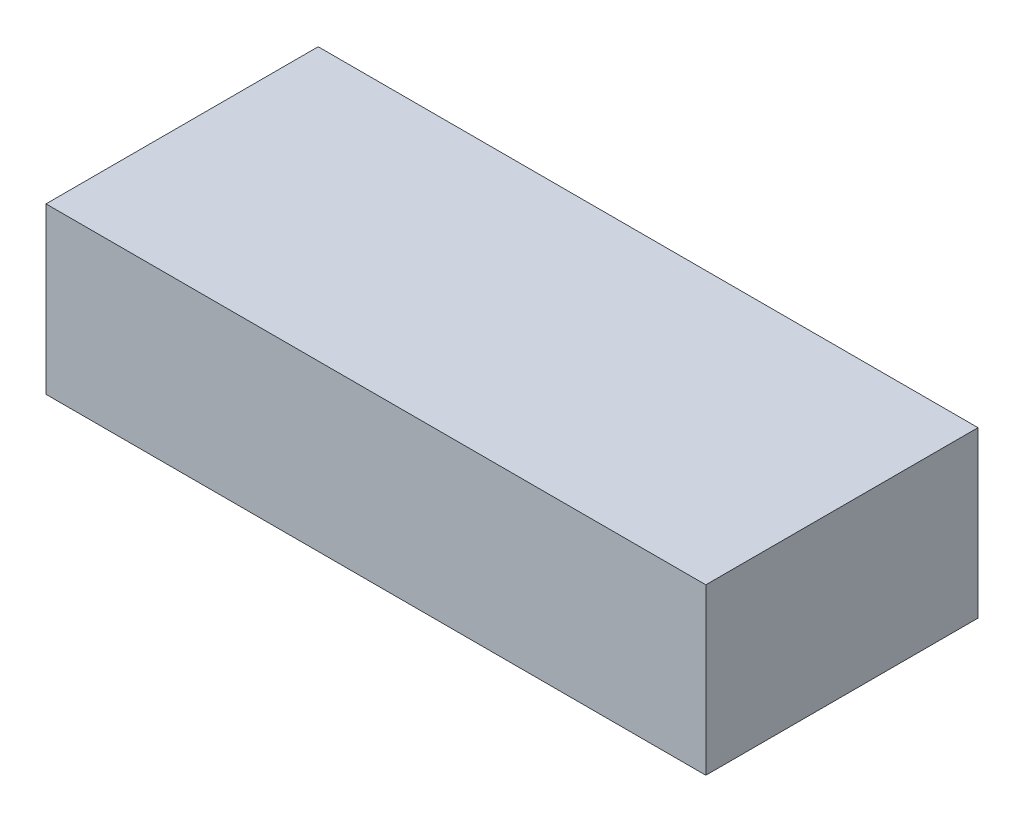
ISO-10303-21;
HEADER;
FILE_DESCRIPTION(('STEP AP214'),'2;1');
FILE_NAME('part.step','',(''),(''),'','','');
FILE_SCHEMA(('AUTOMOTIVE_DESIGN { 1 0 10303 214 1 1 1 1 }'));
ENDSEC;
DATA;
#1=APPLICATION_CONTEXT('core data for automotive mechanical design processes');
#2=APPLICATION_PROTOCOL_DEFINITION('international standard','automotive_design',2000,#1);
#3=PRODUCT_CONTEXT('',#1,'mechanical');
#4=PRODUCT('Part','Part','',(#3));
#5=PRODUCT_RELATED_PRODUCT_CATEGORY('part','',(#4));
#6=PRODUCT_DEFINITION_FORMATION('','',#4);
#7=PRODUCT_DEFINITION_CONTEXT('part definition',#1,'design');
#8=PRODUCT_DEFINITION('design','',#6,#7);
#9=PRODUCT_DEFINITION_SHAPE('','',#8);
#10=(LENGTH_UNIT() NAMED_UNIT(*) SI_UNIT(.MILLI.,.METRE.));
#11=(NAMED_UNIT(*) PLANE_ANGLE_UNIT() SI_UNIT($,.RADIAN.));
#12=(NAMED_UNIT(*) SI_UNIT($,.STERADIAN.) SOLID_ANGLE_UNIT());
#13=UNCERTAINTY_MEASURE_WITH_UNIT(LENGTH_MEASURE(1.E-05),#10,'distance_accuracy_value','');
#14=(GEOMETRIC_REPRESENTATION_CONTEXT(3) GLOBAL_UNCERTAINTY_ASSIGNED_CONTEXT((#13)) GLOBAL_UNIT_ASSIGNED_CONTEXT((#10,
#11,#12)) REPRESENTATION_CONTEXT('',''));
#15=CARTESIAN_POINT('',(0.,0.,0.));
#16=DIRECTION('',(0.,0.,1.));
#17=DIRECTION('',(1.,0.,0.));
#18=AXIS2_PLACEMENT_3D('',#15,#16,#17);
#19=CARTESIAN_POINT('',(-47.1428571428571,20.,-16.5));
#20=DIRECTION('',(1.,0.,0.));
#21=DIRECTION('',(0.,0.,-1.));
#22=AXIS2_PLACEMENT_3D('',#19,#20,#21);
#23=PLANE('',#22);
#24=DIRECTION('',(0.,0.,1.));
#25=VECTOR('',#24,1.);
#26=CARTESIAN_POINT('',(-47.1428571428571,0.,-16.5));
#27=LINE('',#26,#25);
#28=CARTESIAN_POINT('',(-47.1428571428571,0.,-16.5));
#29=VERTEX_POINT('',#28);
#30=CARTESIAN_POINT('',(-47.1428571428571,0.,16.5));
#31=VERTEX_POINT('',#30);
#32=EDGE_CURVE('E97',#29,#31,#27,.T.);
#33=ORIENTED_EDGE('',*,*,#32,.T.);
#34=DIRECTION('',(0.,-1.,0.));
#35=VECTOR('',#34,1.);
#36=CARTESIAN_POINT('',(-47.1428571428571,20.,16.5));
#37=LINE('',#36,#35);
#38=CARTESIAN_POINT('',(-47.1428571428571,20.,16.5));
#39=VERTEX_POINT('',#38);
#40=EDGE_CURVE('E11',#39,#31,#37,.T.);
#41=ORIENTED_EDGE('',*,*,#40,.F.);
#42=DIRECTION('',(0.,0.,1.));
#43=VECTOR('',#42,1.);
#44=CARTESIAN_POINT('',(-47.1428571428571,20.,-16.5));
#45=LINE('',#44,#43);
#46=CARTESIAN_POINT('',(-47.1428571428571,20.,-16.5));
#47=VERTEX_POINT('',#46);
#48=EDGE_CURVE('E85',#47,#39,#45,.T.);
#49=ORIENTED_EDGE('',*,*,#48,.F.);
#50=DIRECTION('',(0.,-1.,0.));
#51=VECTOR('',#50,1.);
#52=CARTESIAN_POINT('',(-47.1428571428571,20.,-16.5));
#53=LINE('',#52,#51);
#54=EDGE_CURVE('E93',#47,#29,#53,.T.);
#55=ORIENTED_EDGE('',*,*,#54,.T.);
#56=EDGE_LOOP('',(#33,#41,#49,#55));
#57=FACE_BOUND('',#56,.T.);
#58=ADVANCED_FACE('F34',(#57),#23,.F.);
#59=CARTESIAN_POINT('',(-47.1428571428571,20.,16.5));
#60=DIRECTION('',(0.,0.,-1.));
#61=DIRECTION('',(-1.,0.,0.));
#62=AXIS2_PLACEMENT_3D('',#59,#60,#61);
#63=PLANE('',#62);
#64=DIRECTION('',(1.,0.,0.));
#65=VECTOR('',#64,1.);
#66=CARTESIAN_POINT('',(-47.1428571428571,0.,16.5));
#67=LINE('',#66,#65);
#68=CARTESIAN_POINT('',(32.8571428571428,0.,16.5));
#69=VERTEX_POINT('',#68);
#70=EDGE_CURVE('E89',#31,#69,#67,.T.);
#71=ORIENTED_EDGE('',*,*,#70,.T.);
#72=DIRECTION('',(0.,-1.,0.));
#73=VECTOR('',#72,1.);
#74=CARTESIAN_POINT('',(32.8571428571428,20.,16.5));
#75=LINE('',#74,#73);
#76=CARTESIAN_POINT('',(32.8571428571428,20.,16.5));
#77=VERTEX_POINT('',#76);
#78=EDGE_CURVE('E42',#77,#69,#75,.T.);
#79=ORIENTED_EDGE('',*,*,#78,.F.);
#80=DIRECTION('',(1.,0.,0.));
#81=VECTOR('',#80,1.);
#82=CARTESIAN_POINT('',(-47.1428571428571,20.,16.5));
#83=LINE('',#82,#81);
#84=EDGE_CURVE('E80',#39,#77,#83,.T.);
#85=ORIENTED_EDGE('',*,*,#84,.F.);
#86=ORIENTED_EDGE('',*,*,#40,.T.);
#87=EDGE_LOOP('',(#71,#79,#85,#86));
#88=FACE_BOUND('',#87,.T.);
#89=ADVANCED_FACE('F88',(#88),#63,.F.);
#90=CARTESIAN_POINT('',(32.8571428571429,20.,-16.5));
#91=DIRECTION('',(-1.,0.,0.));
#92=DIRECTION('',(0.,0.,1.));
#93=AXIS2_PLACEMENT_3D('',#90,#91,#92);
#94=PLANE('',#93);
#95=DIRECTION('',(0.,0.,-1.));
#96=VECTOR('',#95,1.);
#97=CARTESIAN_POINT('',(32.8571428571429,0.,-16.5));
#98=LINE('',#97,#96);
#99=CARTESIAN_POINT('',(32.8571428571429,0.,-16.5));
#100=VERTEX_POINT('',#99);
#101=EDGE_CURVE('E67',#69,#100,#98,.T.);
#102=ORIENTED_EDGE('',*,*,#101,.T.);
#103=DIRECTION('',(0.,-1.,0.));
#104=VECTOR('',#103,1.);
#105=CARTESIAN_POINT('',(32.8571428571429,20.,-16.5));
#106=LINE('',#105,#104);
#107=CARTESIAN_POINT('',(32.8571428571429,20.,-16.5));
#108=VERTEX_POINT('',#107);
#109=EDGE_CURVE('E90',#108,#100,#106,.T.);
#110=ORIENTED_EDGE('',*,*,#109,.F.);
#111=DIRECTION('',(0.,0.,-1.));
#112=VECTOR('',#111,1.);
#113=CARTESIAN_POINT('',(32.8571428571429,20.,-16.5));
#114=LINE('',#113,#112);
#115=EDGE_CURVE('E83',#77,#108,#114,.T.);
#116=ORIENTED_EDGE('',*,*,#115,.F.);
#117=ORIENTED_EDGE('',*,*,#78,.T.);
#118=EDGE_LOOP('',(#102,#110,#116,#117));
#119=FACE_BOUND('',#118,.T.);
#120=ADVANCED_FACE('F91',(#119),#94,.F.);
#121=CARTESIAN_POINT('',(-47.1428571428571,20.,-16.5));
#122=DIRECTION('',(0.,0.,1.));
#123=DIRECTION('',(1.,0.,0.));
#124=AXIS2_PLACEMENT_3D('',#121,#122,#123);
#125=PLANE('',#124);
#126=DIRECTION('',(-1.,0.,0.));
#127=VECTOR('',#126,1.);
#128=CARTESIAN_POINT('',(-47.1428571428571,0.,-16.5));
#129=LINE('',#128,#127);
#130=EDGE_CURVE('E73',#100,#29,#129,.T.);
#131=ORIENTED_EDGE('',*,*,#130,.T.);
#132=ORIENTED_EDGE('',*,*,#54,.F.);
#133=DIRECTION('',(-1.,0.,0.));
#134=VECTOR('',#133,1.);
#135=CARTESIAN_POINT('',(-47.1428571428571,20.,-16.5));
#136=LINE('',#135,#134);
#137=EDGE_CURVE('E50',#108,#47,#136,.T.);
#138=ORIENTED_EDGE('',*,*,#137,.F.);
#139=ORIENTED_EDGE('',*,*,#109,.T.);
#140=EDGE_LOOP('',(#131,#132,#138,#139));
#141=FACE_BOUND('',#140,.T.);
#142=ADVANCED_FACE('F104',(#141),#125,.F.);
#143=CARTESIAN_POINT('',(0.,20.,0.));
#144=DIRECTION('',(0.,1.,0.));
#145=DIRECTION('',(0.,0.,1.));
#146=AXIS2_PLACEMENT_3D('',#143,#144,#145);
#147=PLANE('',#146);
#148=ORIENTED_EDGE('',*,*,#48,.T.);
#149=ORIENTED_EDGE('',*,*,#84,.T.);
#150=ORIENTED_EDGE('',*,*,#115,.T.);
#151=ORIENTED_EDGE('',*,*,#137,.T.);
#152=EDGE_LOOP('',(#148,#149,#150,#151));
#153=FACE_BOUND('',#152,.T.);
#154=ADVANCED_FACE('F81',(#153),#147,.T.);
#155=CARTESIAN_POINT('',(0.,0.,0.));
#156=DIRECTION('',(0.,1.,0.));
#157=DIRECTION('',(0.,0.,1.));
#158=AXIS2_PLACEMENT_3D('',#155,#156,#157);
#159=PLANE('',#158);
#160=ORIENTED_EDGE('',*,*,#32,.F.);
#161=ORIENTED_EDGE('',*,*,#130,.F.);
#162=ORIENTED_EDGE('',*,*,#101,.F.);
#163=ORIENTED_EDGE('',*,*,#70,.F.);
#164=EDGE_LOOP('',(#160,#161,#162,#163));
#165=FACE_BOUND('',#164,.T.);
#166=ADVANCED_FACE('F107',(#165),#159,.F.);
#167=CLOSED_SHELL('',(#58,#89,#120,#142,#154,#166));
#168=MANIFOLD_SOLID_BREP('B2',#167);
#169=ADVANCED_BREP_SHAPE_REPRESENTATION('',(#18,#168),#14);
#170=SHAPE_DEFINITION_REPRESENTATION(#9,#169);
ENDSEC;
END-ISO-10303-21;
